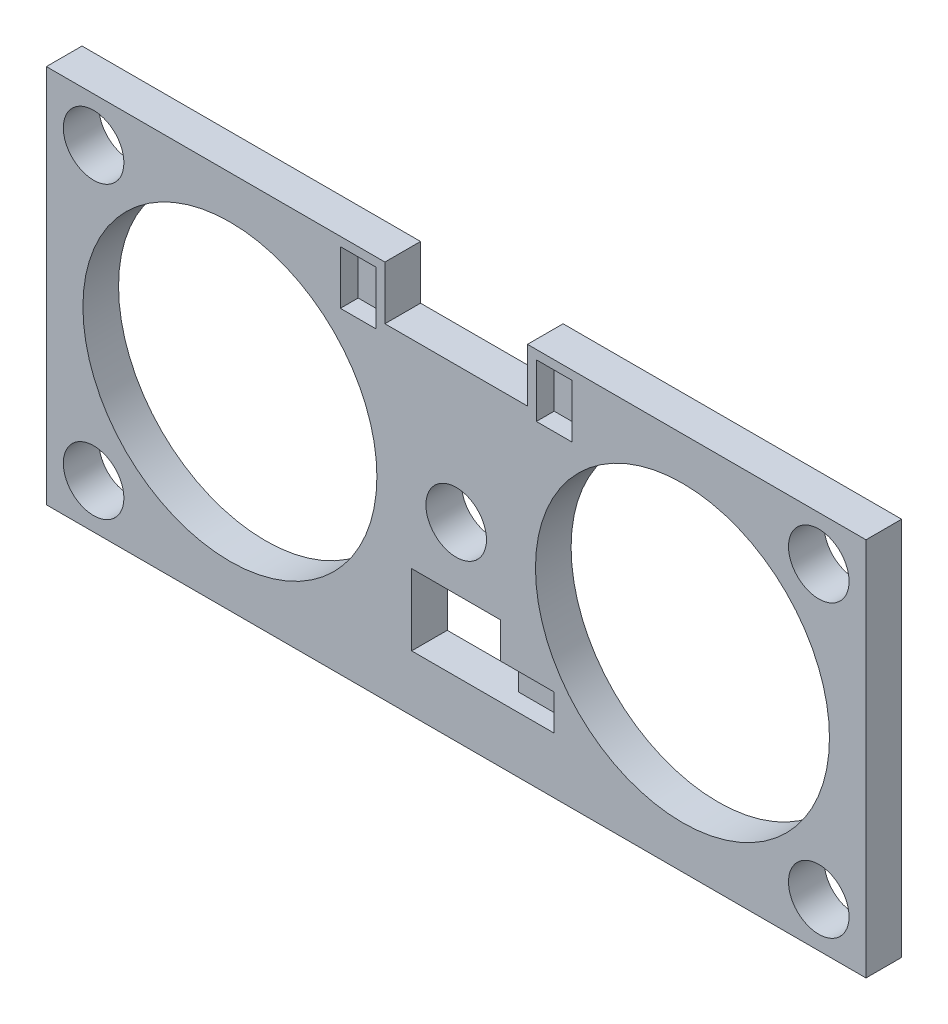
ISO-10303-21;
HEADER;
FILE_DESCRIPTION(('STEP AP214'),'2;1');
FILE_NAME('part.step','',(''),(''),'','','');
FILE_SCHEMA(('AUTOMOTIVE_DESIGN { 1 0 10303 214 1 1 1 1 }'));
ENDSEC;
DATA;
#1=APPLICATION_CONTEXT('core data for automotive mechanical design processes');
#2=APPLICATION_PROTOCOL_DEFINITION('international standard','automotive_design',2000,#1);
#3=PRODUCT_CONTEXT('',#1,'mechanical');
#4=PRODUCT('Part','Part','',(#3));
#5=PRODUCT_RELATED_PRODUCT_CATEGORY('part','',(#4));
#6=PRODUCT_DEFINITION_FORMATION('','',#4);
#7=PRODUCT_DEFINITION_CONTEXT('part definition',#1,'design');
#8=PRODUCT_DEFINITION('design','',#6,#7);
#9=PRODUCT_DEFINITION_SHAPE('','',#8);
#10=(LENGTH_UNIT() NAMED_UNIT(*) SI_UNIT(.MILLI.,.METRE.));
#11=(NAMED_UNIT(*) PLANE_ANGLE_UNIT() SI_UNIT($,.RADIAN.));
#12=(NAMED_UNIT(*) SI_UNIT($,.STERADIAN.) SOLID_ANGLE_UNIT());
#13=UNCERTAINTY_MEASURE_WITH_UNIT(LENGTH_MEASURE(1.E-05),#10,'distance_accuracy_value','');
#14=(GEOMETRIC_REPRESENTATION_CONTEXT(3) GLOBAL_UNCERTAINTY_ASSIGNED_CONTEXT((#13)) GLOBAL_UNIT_ASSIGNED_CONTEXT((#10,
#11,#12)) REPRESENTATION_CONTEXT('',''));
#15=CARTESIAN_POINT('',(0.,0.,0.));
#16=DIRECTION('',(0.,0.,1.));
#17=DIRECTION('',(1.,0.,0.));
#18=AXIS2_PLACEMENT_3D('',#15,#16,#17);
#19=CARTESIAN_POINT('',(0.,0.,2.));
#20=DIRECTION('',(0.,0.,-1.));
#21=DIRECTION('',(-1.,0.,0.));
#22=AXIS2_PLACEMENT_3D('',#19,#20,#21);
#23=PLANE('',#22);
#24=CARTESIAN_POINT('',(0.,0.,2.));
#25=DIRECTION('',(0.,0.,1.));
#26=DIRECTION('',(1.,0.,0.));
#27=AXIS2_PLACEMENT_3D('',#24,#25,#26);
#28=CIRCLE('',#27,1.7);
#29=CARTESIAN_POINT('',(1.7,0.,2.));
#30=VERTEX_POINT('',#29);
#31=EDGE_CURVE('E741',#30,#30,#28,.T.);
#32=ORIENTED_EDGE('',*,*,#31,.F.);
#33=EDGE_LOOP('',(#32));
#34=FACE_BOUND('',#33,.T.);
#35=CARTESIAN_POINT('',(-20.35,-8.15,2.));
#36=DIRECTION('',(0.,0.,1.));
#37=DIRECTION('',(1.,0.,0.));
#38=AXIS2_PLACEMENT_3D('',#35,#36,#37);
#39=CIRCLE('',#38,1.7);
#40=CARTESIAN_POINT('',(-18.65,-8.15,2.));
#41=VERTEX_POINT('',#40);
#42=EDGE_CURVE('E751',#41,#41,#39,.T.);
#43=ORIENTED_EDGE('',*,*,#42,.F.);
#44=EDGE_LOOP('',(#43));
#45=FACE_BOUND('',#44,.T.);
#46=CARTESIAN_POINT('',(-20.35,8.15,2.));
#47=DIRECTION('',(0.,0.,1.));
#48=DIRECTION('',(1.,0.,0.));
#49=AXIS2_PLACEMENT_3D('',#46,#47,#48);
#50=CIRCLE('',#49,1.7);
#51=CARTESIAN_POINT('',(-18.65,8.15,2.));
#52=VERTEX_POINT('',#51);
#53=EDGE_CURVE('E757',#52,#52,#50,.T.);
#54=ORIENTED_EDGE('',*,*,#53,.F.);
#55=EDGE_LOOP('',(#54));
#56=FACE_BOUND('',#55,.T.);
#57=DIRECTION('',(1.,0.,0.));
#58=VECTOR('',#57,1.);
#59=CARTESIAN_POINT('',(-4.5,7.15,2.));
#60=LINE('',#59,#58);
#61=CARTESIAN_POINT('',(-6.5,7.15,2.));
#62=VERTEX_POINT('',#61);
#63=CARTESIAN_POINT('',(-4.5,7.15,2.));
#64=VERTEX_POINT('',#63);
#65=EDGE_CURVE('E242',#62,#64,#60,.T.);
#66=ORIENTED_EDGE('',*,*,#65,.F.);
#67=DIRECTION('',(0.,-1.,0.));
#68=VECTOR('',#67,1.);
#69=CARTESIAN_POINT('',(-6.5,10.15,2.));
#70=LINE('',#69,#68);
#71=CARTESIAN_POINT('',(-6.5,10.15,2.));
#72=VERTEX_POINT('',#71);
#73=EDGE_CURVE('E48',#72,#62,#70,.T.);
#74=ORIENTED_EDGE('',*,*,#73,.F.);
#75=DIRECTION('',(-1.,0.,0.));
#76=VECTOR('',#75,1.);
#77=CARTESIAN_POINT('',(-4.5,10.15,2.));
#78=LINE('',#77,#76);
#79=CARTESIAN_POINT('',(-4.5,10.15,2.));
#80=VERTEX_POINT('',#79);
#81=EDGE_CURVE('E231',#80,#72,#78,.T.);
#82=ORIENTED_EDGE('',*,*,#81,.F.);
#83=DIRECTION('',(0.,1.,0.));
#84=VECTOR('',#83,1.);
#85=CARTESIAN_POINT('',(-4.5,10.15,2.));
#86=LINE('',#85,#84);
#87=EDGE_CURVE('E246',#64,#80,#86,.T.);
#88=ORIENTED_EDGE('',*,*,#87,.F.);
#89=EDGE_LOOP('',(#66,#74,#82,#88));
#90=FACE_BOUND('',#89,.T.);
#91=DIRECTION('',(1.,0.,0.));
#92=VECTOR('',#91,1.);
#93=CARTESIAN_POINT('',(6.5,7.15,2.));
#94=LINE('',#93,#92);
#95=CARTESIAN_POINT('',(4.5,7.15,2.));
#96=VERTEX_POINT('',#95);
#97=CARTESIAN_POINT('',(6.5,7.15,2.));
#98=VERTEX_POINT('',#97);
#99=EDGE_CURVE('E272',#96,#98,#94,.T.);
#100=ORIENTED_EDGE('',*,*,#99,.F.);
#101=DIRECTION('',(0.,-1.,0.));
#102=VECTOR('',#101,1.);
#103=CARTESIAN_POINT('',(4.5,10.15,2.));
#104=LINE('',#103,#102);
#105=CARTESIAN_POINT('',(4.5,10.15,2.));
#106=VERTEX_POINT('',#105);
#107=EDGE_CURVE('E56',#106,#96,#104,.T.);
#108=ORIENTED_EDGE('',*,*,#107,.F.);
#109=DIRECTION('',(-1.,0.,0.));
#110=VECTOR('',#109,1.);
#111=CARTESIAN_POINT('',(6.5,10.15,2.));
#112=LINE('',#111,#110);
#113=CARTESIAN_POINT('',(6.5,10.15,2.));
#114=VERTEX_POINT('',#113);
#115=EDGE_CURVE('E261',#114,#106,#112,.T.);
#116=ORIENTED_EDGE('',*,*,#115,.F.);
#117=DIRECTION('',(0.,1.,0.));
#118=VECTOR('',#117,1.);
#119=CARTESIAN_POINT('',(6.5,10.15,2.));
#120=LINE('',#119,#118);
#121=EDGE_CURVE('E276',#98,#114,#120,.T.);
#122=ORIENTED_EDGE('',*,*,#121,.F.);
#123=EDGE_LOOP('',(#100,#108,#116,#122));
#124=FACE_BOUND('',#123,.T.);
#125=DIRECTION('',(0.,1.,0.));
#126=VECTOR('',#125,1.);
#127=CARTESIAN_POINT('',(2.5,-3.5,2.));
#128=LINE('',#127,#126);
#129=CARTESIAN_POINT('',(2.5,-5.5,2.));
#130=VERTEX_POINT('',#129);
#131=CARTESIAN_POINT('',(2.5,-3.5,2.));
#132=VERTEX_POINT('',#131);
#133=EDGE_CURVE('E225',#130,#132,#128,.T.);
#134=ORIENTED_EDGE('',*,*,#133,.F.);
#135=DIRECTION('',(-1.,0.,0.));
#136=VECTOR('',#135,1.);
#137=CARTESIAN_POINT('',(2.5,-5.5,2.));
#138=LINE('',#137,#136);
#139=CARTESIAN_POINT('',(5.5,-5.5,2.));
#140=VERTEX_POINT('',#139);
#141=EDGE_CURVE('E213',#140,#130,#138,.T.);
#142=ORIENTED_EDGE('',*,*,#141,.F.);
#143=DIRECTION('',(0.,1.,0.));
#144=VECTOR('',#143,1.);
#145=CARTESIAN_POINT('',(5.5,-7.5,2.));
#146=LINE('',#145,#144);
#147=CARTESIAN_POINT('',(5.5,-7.5,2.));
#148=VERTEX_POINT('',#147);
#149=EDGE_CURVE('E218',#148,#140,#146,.T.);
#150=ORIENTED_EDGE('',*,*,#149,.F.);
#151=DIRECTION('',(1.,0.,0.));
#152=VECTOR('',#151,1.);
#153=CARTESIAN_POINT('',(-2.5,-7.5,2.));
#154=LINE('',#153,#152);
#155=CARTESIAN_POINT('',(-2.5,-7.5,2.));
#156=VERTEX_POINT('',#155);
#157=EDGE_CURVE('E195',#156,#148,#154,.T.);
#158=ORIENTED_EDGE('',*,*,#157,.F.);
#159=DIRECTION('',(0.,-1.,0.));
#160=VECTOR('',#159,1.);
#161=CARTESIAN_POINT('',(-2.5,-3.5,2.));
#162=LINE('',#161,#160);
#163=CARTESIAN_POINT('',(-2.5,-3.5,2.));
#164=VERTEX_POINT('',#163);
#165=EDGE_CURVE('E304',#164,#156,#162,.T.);
#166=ORIENTED_EDGE('',*,*,#165,.F.);
#167=DIRECTION('',(-1.,0.,0.));
#168=VECTOR('',#167,1.);
#169=CARTESIAN_POINT('',(-2.5,-3.5,2.));
#170=LINE('',#169,#168);
#171=EDGE_CURVE('E301',#132,#164,#170,.T.);
#172=ORIENTED_EDGE('',*,*,#171,.F.);
#173=EDGE_LOOP('',(#134,#142,#150,#158,#166,#172));
#174=FACE_BOUND('',#173,.T.);
#175=CARTESIAN_POINT('',(-12.7,0.,2.));
#176=DIRECTION('',(0.,0.,1.));
#177=DIRECTION('',(1.,0.,0.));
#178=AXIS2_PLACEMENT_3D('',#175,#176,#177);
#179=CIRCLE('',#178,8.25);
#180=CARTESIAN_POINT('',(-4.45,0.,2.));
#181=VERTEX_POINT('',#180);
#182=EDGE_CURVE('E347',#181,#181,#179,.T.);
#183=ORIENTED_EDGE('',*,*,#182,.F.);
#184=EDGE_LOOP('',(#183));
#185=FACE_BOUND('',#184,.T.);
#186=CARTESIAN_POINT('',(12.7,0.,2.));
#187=DIRECTION('',(0.,0.,1.));
#188=DIRECTION('',(1.,0.,0.));
#189=AXIS2_PLACEMENT_3D('',#186,#187,#188);
#190=CIRCLE('',#189,8.25);
#191=CARTESIAN_POINT('',(20.95,0.,2.));
#192=VERTEX_POINT('',#191);
#193=EDGE_CURVE('E336',#192,#192,#190,.T.);
#194=ORIENTED_EDGE('',*,*,#193,.F.);
#195=EDGE_LOOP('',(#194));
#196=FACE_BOUND('',#195,.T.);
#197=DIRECTION('',(-1.,0.,0.));
#198=VECTOR('',#197,1.);
#199=CARTESIAN_POINT('',(-23.,10.65,2.));
#200=LINE('',#199,#198);
#201=CARTESIAN_POINT('',(23.,10.65,2.));
#202=VERTEX_POINT('',#201);
#203=CARTESIAN_POINT('',(4.,10.65,2.));
#204=VERTEX_POINT('',#203);
#205=EDGE_CURVE('E360',#202,#204,#200,.T.);
#206=ORIENTED_EDGE('',*,*,#205,.T.);
#207=DIRECTION('',(0.,1.,0.));
#208=VECTOR('',#207,1.);
#209=CARTESIAN_POINT('',(4.,7.65,2.));
#210=LINE('',#209,#208);
#211=CARTESIAN_POINT('',(4.,7.65,2.));
#212=VERTEX_POINT('',#211);
#213=EDGE_CURVE('E310',#212,#204,#210,.T.);
#214=ORIENTED_EDGE('',*,*,#213,.F.);
#215=DIRECTION('',(1.,0.,0.));
#216=VECTOR('',#215,1.);
#217=CARTESIAN_POINT('',(-4.,7.65,2.));
#218=LINE('',#217,#216);
#219=CARTESIAN_POINT('',(-4.,7.65,2.));
#220=VERTEX_POINT('',#219);
#221=EDGE_CURVE('E321',#220,#212,#218,.T.);
#222=ORIENTED_EDGE('',*,*,#221,.F.);
#223=DIRECTION('',(0.,-1.,0.));
#224=VECTOR('',#223,1.);
#225=CARTESIAN_POINT('',(-4.,7.65,2.));
#226=LINE('',#225,#224);
#227=CARTESIAN_POINT('',(-4.,10.65,2.));
#228=VERTEX_POINT('',#227);
#229=EDGE_CURVE('E329',#228,#220,#226,.T.);
#230=ORIENTED_EDGE('',*,*,#229,.F.);
#231=CARTESIAN_POINT('',(-23.,10.65,2.));
#232=VERTEX_POINT('',#231);
#233=EDGE_CURVE('E358',#228,#232,#200,.T.);
#234=ORIENTED_EDGE('',*,*,#233,.T.);
#235=DIRECTION('',(0.,-1.,0.));
#236=VECTOR('',#235,1.);
#237=CARTESIAN_POINT('',(-23.,-10.65,2.));
#238=LINE('',#237,#236);
#239=CARTESIAN_POINT('',(-23.,-10.65,2.));
#240=VERTEX_POINT('',#239);
#241=EDGE_CURVE('E363',#232,#240,#238,.T.);
#242=ORIENTED_EDGE('',*,*,#241,.T.);
#243=DIRECTION('',(1.,0.,0.));
#244=VECTOR('',#243,1.);
#245=CARTESIAN_POINT('',(-23.,-10.65,2.));
#246=LINE('',#245,#244);
#247=CARTESIAN_POINT('',(23.,-10.65,2.));
#248=VERTEX_POINT('',#247);
#249=EDGE_CURVE('E365',#240,#248,#246,.T.);
#250=ORIENTED_EDGE('',*,*,#249,.T.);
#251=DIRECTION('',(0.,1.,0.));
#252=VECTOR('',#251,1.);
#253=CARTESIAN_POINT('',(23.,-10.65,2.));
#254=LINE('',#253,#252);
#255=EDGE_CURVE('E355',#248,#202,#254,.T.);
#256=ORIENTED_EDGE('',*,*,#255,.T.);
#257=EDGE_LOOP('',(#206,#214,#222,#230,#234,#242,#250,#256));
#258=FACE_BOUND('',#257,.T.);
#259=CARTESIAN_POINT('',(20.35,-8.15,2.));
#260=DIRECTION('',(0.,0.,1.));
#261=DIRECTION('',(1.,0.,0.));
#262=AXIS2_PLACEMENT_3D('',#259,#260,#261);
#263=CIRCLE('',#262,1.7);
#264=CARTESIAN_POINT('',(22.05,-8.15,2.));
#265=VERTEX_POINT('',#264);
#266=EDGE_CURVE('E763',#265,#265,#263,.T.);
#267=ORIENTED_EDGE('',*,*,#266,.F.);
#268=EDGE_LOOP('',(#267));
#269=FACE_BOUND('',#268,.T.);
#270=CARTESIAN_POINT('',(20.35,8.15,2.));
#271=DIRECTION('',(0.,0.,1.));
#272=DIRECTION('',(1.,0.,0.));
#273=AXIS2_PLACEMENT_3D('',#270,#271,#272);
#274=CIRCLE('',#273,1.7);
#275=CARTESIAN_POINT('',(22.05,8.15,2.));
#276=VERTEX_POINT('',#275);
#277=EDGE_CURVE('E743',#276,#276,#274,.T.);
#278=ORIENTED_EDGE('',*,*,#277,.F.);
#279=EDGE_LOOP('',(#278));
#280=FACE_BOUND('',#279,.T.);
#281=ADVANCED_FACE('F33',(#34,#45,#56,#90,#124,#174,#185,#196,#258,#269,#280),#23,.F.);
#282=CARTESIAN_POINT('',(0.,0.,0.));
#283=DIRECTION('',(0.,0.,-1.));
#284=DIRECTION('',(-1.,0.,0.));
#285=AXIS2_PLACEMENT_3D('',#282,#283,#284);
#286=PLANE('',#285);
#287=CARTESIAN_POINT('',(0.,0.,0.));
#288=DIRECTION('',(0.,0.,1.));
#289=DIRECTION('',(1.,0.,0.));
#290=AXIS2_PLACEMENT_3D('',#287,#288,#289);
#291=CIRCLE('',#290,1.7);
#292=CARTESIAN_POINT('',(1.7,0.,0.));
#293=VERTEX_POINT('',#292);
#294=EDGE_CURVE('E739',#293,#293,#291,.T.);
#295=ORIENTED_EDGE('',*,*,#294,.T.);
#296=EDGE_LOOP('',(#295));
#297=FACE_BOUND('',#296,.T.);
#298=CARTESIAN_POINT('',(20.35,8.15,0.));
#299=DIRECTION('',(0.,0.,1.));
#300=DIRECTION('',(1.,0.,0.));
#301=AXIS2_PLACEMENT_3D('',#298,#299,#300);
#302=CIRCLE('',#301,1.7);
#303=CARTESIAN_POINT('',(22.05,8.15,0.));
#304=VERTEX_POINT('',#303);
#305=EDGE_CURVE('E748',#304,#304,#302,.T.);
#306=ORIENTED_EDGE('',*,*,#305,.T.);
#307=EDGE_LOOP('',(#306));
#308=FACE_BOUND('',#307,.T.);
#309=CARTESIAN_POINT('',(-20.35,-8.15,0.));
#310=DIRECTION('',(0.,0.,1.));
#311=DIRECTION('',(1.,0.,0.));
#312=AXIS2_PLACEMENT_3D('',#309,#310,#311);
#313=CIRCLE('',#312,1.7);
#314=CARTESIAN_POINT('',(-18.65,-8.15,0.));
#315=VERTEX_POINT('',#314);
#316=EDGE_CURVE('E754',#315,#315,#313,.T.);
#317=ORIENTED_EDGE('',*,*,#316,.T.);
#318=EDGE_LOOP('',(#317));
#319=FACE_BOUND('',#318,.T.);
#320=CARTESIAN_POINT('',(-20.35,8.15,0.));
#321=DIRECTION('',(0.,0.,1.));
#322=DIRECTION('',(1.,0.,0.));
#323=AXIS2_PLACEMENT_3D('',#320,#321,#322);
#324=CIRCLE('',#323,1.7);
#325=CARTESIAN_POINT('',(-18.65,8.15,0.));
#326=VERTEX_POINT('',#325);
#327=EDGE_CURVE('E760',#326,#326,#324,.T.);
#328=ORIENTED_EDGE('',*,*,#327,.T.);
#329=EDGE_LOOP('',(#328));
#330=FACE_BOUND('',#329,.T.);
#331=CARTESIAN_POINT('',(12.7,0.,0.));
#332=DIRECTION('',(0.,0.,1.));
#333=DIRECTION('',(1.,0.,0.));
#334=AXIS2_PLACEMENT_3D('',#331,#332,#333);
#335=CIRCLE('',#334,8.25);
#336=CARTESIAN_POINT('',(20.95,0.,0.));
#337=VERTEX_POINT('',#336);
#338=EDGE_CURVE('E350',#337,#337,#335,.T.);
#339=ORIENTED_EDGE('',*,*,#338,.T.);
#340=EDGE_LOOP('',(#339));
#341=FACE_BOUND('',#340,.T.);
#342=CARTESIAN_POINT('',(-12.7,0.,0.));
#343=DIRECTION('',(0.,0.,1.));
#344=DIRECTION('',(1.,0.,0.));
#345=AXIS2_PLACEMENT_3D('',#342,#343,#344);
#346=CIRCLE('',#345,8.25);
#347=CARTESIAN_POINT('',(-4.45,0.,0.));
#348=VERTEX_POINT('',#347);
#349=EDGE_CURVE('E343',#348,#348,#346,.T.);
#350=ORIENTED_EDGE('',*,*,#349,.T.);
#351=EDGE_LOOP('',(#350));
#352=FACE_BOUND('',#351,.T.);
#353=DIRECTION('',(0.,1.,0.));
#354=VECTOR('',#353,1.);
#355=CARTESIAN_POINT('',(4.,7.65,0.));
#356=LINE('',#355,#354);
#357=CARTESIAN_POINT('',(4.,7.65,0.));
#358=VERTEX_POINT('',#357);
#359=CARTESIAN_POINT('',(4.,10.65,0.));
#360=VERTEX_POINT('',#359);
#361=EDGE_CURVE('E317',#358,#360,#356,.T.);
#362=ORIENTED_EDGE('',*,*,#361,.T.);
#363=DIRECTION('',(-1.,0.,0.));
#364=VECTOR('',#363,1.);
#365=CARTESIAN_POINT('',(-23.,10.65,0.));
#366=LINE('',#365,#364);
#367=CARTESIAN_POINT('',(23.,10.65,0.));
#368=VERTEX_POINT('',#367);
#369=EDGE_CURVE('E371',#368,#360,#366,.T.);
#370=ORIENTED_EDGE('',*,*,#369,.F.);
#371=DIRECTION('',(0.,1.,0.));
#372=VECTOR('',#371,1.);
#373=CARTESIAN_POINT('',(23.,-10.65,0.));
#374=LINE('',#373,#372);
#375=CARTESIAN_POINT('',(23.,-10.65,0.));
#376=VERTEX_POINT('',#375);
#377=EDGE_CURVE('E346',#376,#368,#374,.T.);
#378=ORIENTED_EDGE('',*,*,#377,.F.);
#379=DIRECTION('',(1.,0.,0.));
#380=VECTOR('',#379,1.);
#381=CARTESIAN_POINT('',(-23.,-10.65,0.));
#382=LINE('',#381,#380);
#383=CARTESIAN_POINT('',(-23.,-10.65,0.));
#384=VERTEX_POINT('',#383);
#385=EDGE_CURVE('E359',#384,#376,#382,.T.);
#386=ORIENTED_EDGE('',*,*,#385,.F.);
#387=DIRECTION('',(0.,-1.,0.));
#388=VECTOR('',#387,1.);
#389=CARTESIAN_POINT('',(-23.,-10.65,0.));
#390=LINE('',#389,#388);
#391=CARTESIAN_POINT('',(-23.,10.65,0.));
#392=VERTEX_POINT('',#391);
#393=EDGE_CURVE('E374',#392,#384,#390,.T.);
#394=ORIENTED_EDGE('',*,*,#393,.F.);
#395=CARTESIAN_POINT('',(-4.,10.65,0.));
#396=VERTEX_POINT('',#395);
#397=EDGE_CURVE('E370',#396,#392,#366,.T.);
#398=ORIENTED_EDGE('',*,*,#397,.F.);
#399=DIRECTION('',(0.,-1.,0.));
#400=VECTOR('',#399,1.);
#401=CARTESIAN_POINT('',(-4.,7.65,0.));
#402=LINE('',#401,#400);
#403=CARTESIAN_POINT('',(-4.,7.65,0.));
#404=VERTEX_POINT('',#403);
#405=EDGE_CURVE('E320',#396,#404,#402,.T.);
#406=ORIENTED_EDGE('',*,*,#405,.T.);
#407=DIRECTION('',(1.,0.,0.));
#408=VECTOR('',#407,1.);
#409=CARTESIAN_POINT('',(-4.,7.65,0.));
#410=LINE('',#409,#408);
#411=EDGE_CURVE('E324',#404,#358,#410,.T.);
#412=ORIENTED_EDGE('',*,*,#411,.T.);
#413=EDGE_LOOP('',(#362,#370,#378,#386,#394,#398,#406,#412));
#414=FACE_BOUND('',#413,.T.);
#415=DIRECTION('',(0.,1.,0.));
#416=VECTOR('',#415,1.);
#417=CARTESIAN_POINT('',(2.5,-3.5,0.));
#418=LINE('',#417,#416);
#419=CARTESIAN_POINT('',(2.5,-7.5,0.));
#420=VERTEX_POINT('',#419);
#421=CARTESIAN_POINT('',(2.5,-3.5,0.));
#422=VERTEX_POINT('',#421);
#423=EDGE_CURVE('E287',#420,#422,#418,.T.);
#424=ORIENTED_EDGE('',*,*,#423,.T.);
#425=DIRECTION('',(-1.,0.,0.));
#426=VECTOR('',#425,1.);
#427=CARTESIAN_POINT('',(-2.5,-3.5,0.));
#428=LINE('',#427,#426);
#429=CARTESIAN_POINT('',(-2.5,-3.5,0.));
#430=VERTEX_POINT('',#429);
#431=EDGE_CURVE('E290',#422,#430,#428,.T.);
#432=ORIENTED_EDGE('',*,*,#431,.T.);
#433=DIRECTION('',(0.,-1.,0.));
#434=VECTOR('',#433,1.);
#435=CARTESIAN_POINT('',(-2.5,-3.5,0.));
#436=LINE('',#435,#434);
#437=CARTESIAN_POINT('',(-2.5,-7.5,0.));
#438=VERTEX_POINT('',#437);
#439=EDGE_CURVE('E293',#430,#438,#436,.T.);
#440=ORIENTED_EDGE('',*,*,#439,.T.);
#441=DIRECTION('',(1.,0.,0.));
#442=VECTOR('',#441,1.);
#443=CARTESIAN_POINT('',(-2.5,-7.5,0.));
#444=LINE('',#443,#442);
#445=EDGE_CURVE('E296',#438,#420,#444,.T.);
#446=ORIENTED_EDGE('',*,*,#445,.T.);
#447=EDGE_LOOP('',(#424,#432,#440,#446));
#448=FACE_BOUND('',#447,.T.);
#449=CARTESIAN_POINT('',(20.35,-8.15,0.));
#450=DIRECTION('',(0.,0.,1.));
#451=DIRECTION('',(1.,0.,0.));
#452=AXIS2_PLACEMENT_3D('',#449,#450,#451);
#453=CIRCLE('',#452,1.7);
#454=CARTESIAN_POINT('',(22.05,-8.15,0.));
#455=VERTEX_POINT('',#454);
#456=EDGE_CURVE('E273',#455,#455,#453,.T.);
#457=ORIENTED_EDGE('',*,*,#456,.T.);
#458=EDGE_LOOP('',(#457));
#459=FACE_BOUND('',#458,.T.);
#460=ADVANCED_FACE('F393',(#297,#308,#319,#330,#341,#352,#414,#448,#459),#286,.T.);
#461=CARTESIAN_POINT('',(-23.,10.65,2.));
#462=DIRECTION('',(0.,-1.,0.));
#463=DIRECTION('',(0.,0.,-1.));
#464=AXIS2_PLACEMENT_3D('',#461,#462,#463);
#465=PLANE('',#464);
#466=ORIENTED_EDGE('',*,*,#369,.T.);
#467=DIRECTION('',(0.,0.,1.));
#468=VECTOR('',#467,1.);
#469=CARTESIAN_POINT('',(4.,10.65,0.));
#470=LINE('',#469,#468);
#471=EDGE_CURVE('E327',#360,#204,#470,.T.);
#472=ORIENTED_EDGE('',*,*,#471,.T.);
#473=ORIENTED_EDGE('',*,*,#205,.F.);
#474=DIRECTION('',(0.,0.,-1.));
#475=VECTOR('',#474,1.);
#476=CARTESIAN_POINT('',(23.,10.65,2.));
#477=LINE('',#476,#475);
#478=EDGE_CURVE('E11',#202,#368,#477,.T.);
#479=ORIENTED_EDGE('',*,*,#478,.T.);
#480=EDGE_LOOP('',(#466,#472,#473,#479));
#481=FACE_BOUND('',#480,.T.);
#482=ADVANCED_FACE('F419',(#481),#465,.F.);
#483=CARTESIAN_POINT('',(23.,-10.65,2.));
#484=DIRECTION('',(-1.,0.,0.));
#485=DIRECTION('',(0.,0.,1.));
#486=AXIS2_PLACEMENT_3D('',#483,#484,#485);
#487=PLANE('',#486);
#488=ORIENTED_EDGE('',*,*,#377,.T.);
#489=ORIENTED_EDGE('',*,*,#478,.F.);
#490=ORIENTED_EDGE('',*,*,#255,.F.);
#491=DIRECTION('',(0.,0.,-1.));
#492=VECTOR('',#491,1.);
#493=CARTESIAN_POINT('',(23.,-10.65,2.));
#494=LINE('',#493,#492);
#495=EDGE_CURVE('E367',#248,#376,#494,.T.);
#496=ORIENTED_EDGE('',*,*,#495,.T.);
#497=EDGE_LOOP('',(#488,#489,#490,#496));
#498=FACE_BOUND('',#497,.T.);
#499=ADVANCED_FACE('F35',(#498),#487,.F.);
#500=ORIENTED_EDGE('',*,*,#233,.F.);
#501=DIRECTION('',(0.,0.,1.));
#502=VECTOR('',#501,1.);
#503=CARTESIAN_POINT('',(-4.,10.65,0.));
#504=LINE('',#503,#502);
#505=EDGE_CURVE('E339',#396,#228,#504,.T.);
#506=ORIENTED_EDGE('',*,*,#505,.F.);
#507=ORIENTED_EDGE('',*,*,#397,.T.);
#508=DIRECTION('',(0.,0.,-1.));
#509=VECTOR('',#508,1.);
#510=CARTESIAN_POINT('',(-23.,10.65,2.));
#511=LINE('',#510,#509);
#512=EDGE_CURVE('E41',#232,#392,#511,.T.);
#513=ORIENTED_EDGE('',*,*,#512,.F.);
#514=EDGE_LOOP('',(#500,#506,#507,#513));
#515=FACE_BOUND('',#514,.T.);
#516=ADVANCED_FACE('F409',(#515),#465,.F.);
#517=CARTESIAN_POINT('',(-23.,-10.65,2.));
#518=DIRECTION('',(1.,0.,0.));
#519=DIRECTION('',(0.,0.,-1.));
#520=AXIS2_PLACEMENT_3D('',#517,#518,#519);
#521=PLANE('',#520);
#522=ORIENTED_EDGE('',*,*,#393,.T.);
#523=DIRECTION('',(0.,0.,-1.));
#524=VECTOR('',#523,1.);
#525=CARTESIAN_POINT('',(-23.,-10.65,2.));
#526=LINE('',#525,#524);
#527=EDGE_CURVE('E379',#240,#384,#526,.T.);
#528=ORIENTED_EDGE('',*,*,#527,.F.);
#529=ORIENTED_EDGE('',*,*,#241,.F.);
#530=ORIENTED_EDGE('',*,*,#512,.T.);
#531=EDGE_LOOP('',(#522,#528,#529,#530));
#532=FACE_BOUND('',#531,.T.);
#533=ADVANCED_FACE('F386',(#532),#521,.F.);
#534=CARTESIAN_POINT('',(-23.,-10.65,2.));
#535=DIRECTION('',(0.,1.,0.));
#536=DIRECTION('',(0.,0.,1.));
#537=AXIS2_PLACEMENT_3D('',#534,#535,#536);
#538=PLANE('',#537);
#539=ORIENTED_EDGE('',*,*,#385,.T.);
#540=ORIENTED_EDGE('',*,*,#495,.F.);
#541=ORIENTED_EDGE('',*,*,#249,.F.);
#542=ORIENTED_EDGE('',*,*,#527,.T.);
#543=EDGE_LOOP('',(#539,#540,#541,#542));
#544=FACE_BOUND('',#543,.T.);
#545=ADVANCED_FACE('F398',(#544),#538,.F.);
#546=CARTESIAN_POINT('',(12.7,0.,0.));
#547=DIRECTION('',(0.,0.,1.));
#548=DIRECTION('',(1.,0.,0.));
#549=AXIS2_PLACEMENT_3D('',#546,#547,#548);
#550=CYLINDRICAL_SURFACE('',#549,8.25);
#551=ORIENTED_EDGE('',*,*,#338,.F.);
#552=EDGE_LOOP('',(#551));
#553=FACE_BOUND('',#552,.T.);
#554=ORIENTED_EDGE('',*,*,#193,.T.);
#555=EDGE_LOOP('',(#554));
#556=FACE_BOUND('',#555,.T.);
#557=ADVANCED_FACE('F437',(#553,#556),#550,.F.);
#558=CARTESIAN_POINT('',(-12.7,0.,0.));
#559=DIRECTION('',(0.,0.,1.));
#560=DIRECTION('',(1.,0.,0.));
#561=AXIS2_PLACEMENT_3D('',#558,#559,#560);
#562=CYLINDRICAL_SURFACE('',#561,8.25);
#563=ORIENTED_EDGE('',*,*,#349,.F.);
#564=EDGE_LOOP('',(#563));
#565=FACE_BOUND('',#564,.T.);
#566=ORIENTED_EDGE('',*,*,#182,.T.);
#567=EDGE_LOOP('',(#566));
#568=FACE_BOUND('',#567,.T.);
#569=ADVANCED_FACE('F457',(#565,#568),#562,.F.);
#570=CARTESIAN_POINT('',(4.,7.65,0.));
#571=DIRECTION('',(1.,0.,0.));
#572=DIRECTION('',(0.,0.,-1.));
#573=AXIS2_PLACEMENT_3D('',#570,#571,#572);
#574=PLANE('',#573);
#575=ORIENTED_EDGE('',*,*,#213,.T.);
#576=ORIENTED_EDGE('',*,*,#471,.F.);
#577=ORIENTED_EDGE('',*,*,#361,.F.);
#578=DIRECTION('',(0.,0.,1.));
#579=VECTOR('',#578,1.);
#580=CARTESIAN_POINT('',(4.,7.65,0.));
#581=LINE('',#580,#579);
#582=EDGE_CURVE('E334',#358,#212,#581,.T.);
#583=ORIENTED_EDGE('',*,*,#582,.T.);
#584=EDGE_LOOP('',(#575,#576,#577,#583));
#585=FACE_BOUND('',#584,.T.);
#586=ADVANCED_FACE('F417',(#585),#574,.F.);
#587=CARTESIAN_POINT('',(-4.,7.65,0.));
#588=DIRECTION('',(0.,-1.,0.));
#589=DIRECTION('',(0.,0.,-1.));
#590=AXIS2_PLACEMENT_3D('',#587,#588,#589);
#591=PLANE('',#590);
#592=ORIENTED_EDGE('',*,*,#221,.T.);
#593=ORIENTED_EDGE('',*,*,#582,.F.);
#594=ORIENTED_EDGE('',*,*,#411,.F.);
#595=DIRECTION('',(0.,0.,1.));
#596=VECTOR('',#595,1.);
#597=CARTESIAN_POINT('',(-4.,7.65,0.));
#598=LINE('',#597,#596);
#599=EDGE_CURVE('E337',#404,#220,#598,.T.);
#600=ORIENTED_EDGE('',*,*,#599,.T.);
#601=EDGE_LOOP('',(#592,#593,#594,#600));
#602=FACE_BOUND('',#601,.T.);
#603=ADVANCED_FACE('F415',(#602),#591,.F.);
#604=CARTESIAN_POINT('',(-4.,7.65,0.));
#605=DIRECTION('',(-1.,0.,0.));
#606=DIRECTION('',(0.,0.,1.));
#607=AXIS2_PLACEMENT_3D('',#604,#605,#606);
#608=PLANE('',#607);
#609=ORIENTED_EDGE('',*,*,#229,.T.);
#610=ORIENTED_EDGE('',*,*,#599,.F.);
#611=ORIENTED_EDGE('',*,*,#405,.F.);
#612=ORIENTED_EDGE('',*,*,#505,.T.);
#613=EDGE_LOOP('',(#609,#610,#611,#612));
#614=FACE_BOUND('',#613,.T.);
#615=ADVANCED_FACE('F411',(#614),#608,.F.);
#616=CARTESIAN_POINT('',(2.5,-3.5,0.));
#617=DIRECTION('',(1.,0.,0.));
#618=DIRECTION('',(0.,1.,0.));
#619=AXIS2_PLACEMENT_3D('',#616,#617,#618);
#620=PLANE('',#619);
#621=DIRECTION('',(0.,-1.,0.));
#622=VECTOR('',#621,1.);
#623=CARTESIAN_POINT('',(2.5,-7.5,1.));
#624=LINE('',#623,#622);
#625=CARTESIAN_POINT('',(2.5,-5.5,1.));
#626=VERTEX_POINT('',#625);
#627=CARTESIAN_POINT('',(2.5,-7.5,1.));
#628=VERTEX_POINT('',#627);
#629=EDGE_CURVE('E211',#626,#628,#624,.T.);
#630=ORIENTED_EDGE('',*,*,#629,.F.);
#631=DIRECTION('',(0.,0.,1.));
#632=VECTOR('',#631,1.);
#633=CARTESIAN_POINT('',(2.5,-5.5,1.));
#634=LINE('',#633,#632);
#635=EDGE_CURVE('E222',#626,#130,#634,.T.);
#636=ORIENTED_EDGE('',*,*,#635,.T.);
#637=ORIENTED_EDGE('',*,*,#133,.T.);
#638=DIRECTION('',(0.,0.,1.));
#639=VECTOR('',#638,1.);
#640=CARTESIAN_POINT('',(2.5,-3.5,0.));
#641=LINE('',#640,#639);
#642=EDGE_CURVE('E299',#422,#132,#641,.T.);
#643=ORIENTED_EDGE('',*,*,#642,.F.);
#644=ORIENTED_EDGE('',*,*,#423,.F.);
#645=DIRECTION('',(0.,0.,1.));
#646=VECTOR('',#645,1.);
#647=CARTESIAN_POINT('',(2.5,-7.5,0.));
#648=LINE('',#647,#646);
#649=EDGE_CURVE('E308',#420,#628,#648,.T.);
#650=ORIENTED_EDGE('',*,*,#649,.T.);
#651=EDGE_LOOP('',(#630,#636,#637,#643,#644,#650));
#652=FACE_BOUND('',#651,.T.);
#653=ADVANCED_FACE('F482',(#652),#620,.F.);
#654=CARTESIAN_POINT('',(-2.5,-7.5,0.));
#655=DIRECTION('',(0.,-1.,0.));
#656=DIRECTION('',(0.,0.,-1.));
#657=AXIS2_PLACEMENT_3D('',#654,#655,#656);
#658=PLANE('',#657);
#659=ORIENTED_EDGE('',*,*,#157,.T.);
#660=DIRECTION('',(0.,0.,1.));
#661=VECTOR('',#660,1.);
#662=CARTESIAN_POINT('',(5.5,-7.5,1.));
#663=LINE('',#662,#661);
#664=CARTESIAN_POINT('',(5.5,-7.5,1.));
#665=VERTEX_POINT('',#664);
#666=EDGE_CURVE('E188',#665,#148,#663,.T.);
#667=ORIENTED_EDGE('',*,*,#666,.F.);
#668=DIRECTION('',(1.,0.,0.));
#669=VECTOR('',#668,1.);
#670=CARTESIAN_POINT('',(2.5,-7.5,1.));
#671=LINE('',#670,#669);
#672=EDGE_CURVE('E192',#628,#665,#671,.T.);
#673=ORIENTED_EDGE('',*,*,#672,.F.);
#674=ORIENTED_EDGE('',*,*,#649,.F.);
#675=ORIENTED_EDGE('',*,*,#445,.F.);
#676=DIRECTION('',(0.,0.,1.));
#677=VECTOR('',#676,1.);
#678=CARTESIAN_POINT('',(-2.5,-7.5,0.));
#679=LINE('',#678,#677);
#680=EDGE_CURVE('E311',#438,#156,#679,.T.);
#681=ORIENTED_EDGE('',*,*,#680,.T.);
#682=EDGE_LOOP('',(#659,#667,#673,#674,#675,#681));
#683=FACE_BOUND('',#682,.T.);
#684=ADVANCED_FACE('F190',(#683),#658,.F.);
#685=CARTESIAN_POINT('',(-2.5,-3.5,0.));
#686=DIRECTION('',(-1.,0.,0.));
#687=DIRECTION('',(0.,-1.,0.));
#688=AXIS2_PLACEMENT_3D('',#685,#686,#687);
#689=PLANE('',#688);
#690=ORIENTED_EDGE('',*,*,#165,.T.);
#691=ORIENTED_EDGE('',*,*,#680,.F.);
#692=ORIENTED_EDGE('',*,*,#439,.F.);
#693=DIRECTION('',(0.,0.,1.));
#694=VECTOR('',#693,1.);
#695=CARTESIAN_POINT('',(-2.5,-3.5,0.));
#696=LINE('',#695,#694);
#697=EDGE_CURVE('E313',#430,#164,#696,.T.);
#698=ORIENTED_EDGE('',*,*,#697,.T.);
#699=EDGE_LOOP('',(#690,#691,#692,#698));
#700=FACE_BOUND('',#699,.T.);
#701=ADVANCED_FACE('F498',(#700),#689,.F.);
#702=CARTESIAN_POINT('',(-2.5,-3.5,0.));
#703=DIRECTION('',(0.,1.,0.));
#704=DIRECTION('',(0.,0.,1.));
#705=AXIS2_PLACEMENT_3D('',#702,#703,#704);
#706=PLANE('',#705);
#707=ORIENTED_EDGE('',*,*,#171,.T.);
#708=ORIENTED_EDGE('',*,*,#697,.F.);
#709=ORIENTED_EDGE('',*,*,#431,.F.);
#710=ORIENTED_EDGE('',*,*,#642,.T.);
#711=EDGE_LOOP('',(#707,#708,#709,#710));
#712=FACE_BOUND('',#711,.T.);
#713=ADVANCED_FACE('F505',(#712),#706,.F.);
#714=CARTESIAN_POINT('',(2.5,-5.5,1.));
#715=DIRECTION('',(0.,1.,0.));
#716=DIRECTION('',(0.,0.,1.));
#717=AXIS2_PLACEMENT_3D('',#714,#715,#716);
#718=PLANE('',#717);
#719=ORIENTED_EDGE('',*,*,#141,.T.);
#720=ORIENTED_EDGE('',*,*,#635,.F.);
#721=DIRECTION('',(-1.,0.,0.));
#722=VECTOR('',#721,1.);
#723=CARTESIAN_POINT('',(2.5,-5.5,1.));
#724=LINE('',#723,#722);
#725=CARTESIAN_POINT('',(5.5,-5.5,1.));
#726=VERTEX_POINT('',#725);
#727=EDGE_CURVE('E200',#726,#626,#724,.T.);
#728=ORIENTED_EDGE('',*,*,#727,.F.);
#729=DIRECTION('',(0.,0.,1.));
#730=VECTOR('',#729,1.);
#731=CARTESIAN_POINT('',(5.5,-5.5,1.));
#732=LINE('',#731,#730);
#733=EDGE_CURVE('E199',#726,#140,#732,.T.);
#734=ORIENTED_EDGE('',*,*,#733,.T.);
#735=EDGE_LOOP('',(#719,#720,#728,#734));
#736=FACE_BOUND('',#735,.T.);
#737=ADVANCED_FACE('F512',(#736),#718,.F.);
#738=CARTESIAN_POINT('',(5.5,-7.5,1.));
#739=DIRECTION('',(1.,0.,0.));
#740=DIRECTION('',(0.,0.,-1.));
#741=AXIS2_PLACEMENT_3D('',#738,#739,#740);
#742=PLANE('',#741);
#743=ORIENTED_EDGE('',*,*,#149,.T.);
#744=ORIENTED_EDGE('',*,*,#733,.F.);
#745=DIRECTION('',(0.,1.,0.));
#746=VECTOR('',#745,1.);
#747=CARTESIAN_POINT('',(5.5,-7.5,1.));
#748=LINE('',#747,#746);
#749=EDGE_CURVE('E203',#665,#726,#748,.T.);
#750=ORIENTED_EDGE('',*,*,#749,.F.);
#751=ORIENTED_EDGE('',*,*,#666,.T.);
#752=EDGE_LOOP('',(#743,#744,#750,#751));
#753=FACE_BOUND('',#752,.T.);
#754=ADVANCED_FACE('F204',(#753),#742,.F.);
#755=CARTESIAN_POINT('',(0.,0.,1.));
#756=DIRECTION('',(0.,0.,-1.));
#757=DIRECTION('',(-1.,0.,0.));
#758=AXIS2_PLACEMENT_3D('',#755,#756,#757);
#759=PLANE('',#758);
#760=ORIENTED_EDGE('',*,*,#629,.T.);
#761=ORIENTED_EDGE('',*,*,#672,.T.);
#762=ORIENTED_EDGE('',*,*,#749,.T.);
#763=ORIENTED_EDGE('',*,*,#727,.T.);
#764=EDGE_LOOP('',(#760,#761,#762,#763));
#765=FACE_BOUND('',#764,.T.);
#766=ADVANCED_FACE('F209',(#765),#759,.F.);
#767=CARTESIAN_POINT('',(4.5,10.15,1.));
#768=DIRECTION('',(-1.,0.,0.));
#769=DIRECTION('',(0.,0.,1.));
#770=AXIS2_PLACEMENT_3D('',#767,#768,#769);
#771=PLANE('',#770);
#772=ORIENTED_EDGE('',*,*,#107,.T.);
#773=DIRECTION('',(0.,0.,1.));
#774=VECTOR('',#773,1.);
#775=CARTESIAN_POINT('',(4.5,7.15,1.));
#776=LINE('',#775,#774);
#777=CARTESIAN_POINT('',(4.5,7.15,1.));
#778=VERTEX_POINT('',#777);
#779=EDGE_CURVE('E270',#778,#96,#776,.T.);
#780=ORIENTED_EDGE('',*,*,#779,.F.);
#781=DIRECTION('',(0.,-1.,0.));
#782=VECTOR('',#781,1.);
#783=CARTESIAN_POINT('',(4.5,10.15,1.));
#784=LINE('',#783,#782);
#785=CARTESIAN_POINT('',(4.5,10.15,1.));
#786=VERTEX_POINT('',#785);
#787=EDGE_CURVE('E257',#786,#778,#784,.T.);
#788=ORIENTED_EDGE('',*,*,#787,.F.);
#789=DIRECTION('',(0.,0.,1.));
#790=VECTOR('',#789,1.);
#791=CARTESIAN_POINT('',(4.5,10.15,1.));
#792=LINE('',#791,#790);
#793=EDGE_CURVE('E243',#786,#106,#792,.T.);
#794=ORIENTED_EDGE('',*,*,#793,.T.);
#795=EDGE_LOOP('',(#772,#780,#788,#794));
#796=FACE_BOUND('',#795,.T.);
#797=ADVANCED_FACE('F532',(#796),#771,.F.);
#798=CARTESIAN_POINT('',(6.5,10.15,1.));
#799=DIRECTION('',(0.,1.,0.));
#800=DIRECTION('',(0.,0.,1.));
#801=AXIS2_PLACEMENT_3D('',#798,#799,#800);
#802=PLANE('',#801);
#803=ORIENTED_EDGE('',*,*,#115,.T.);
#804=ORIENTED_EDGE('',*,*,#793,.F.);
#805=DIRECTION('',(-1.,0.,0.));
#806=VECTOR('',#805,1.);
#807=CARTESIAN_POINT('',(6.5,10.15,1.));
#808=LINE('',#807,#806);
#809=CARTESIAN_POINT('',(6.5,10.15,1.));
#810=VERTEX_POINT('',#809);
#811=EDGE_CURVE('E267',#810,#786,#808,.T.);
#812=ORIENTED_EDGE('',*,*,#811,.F.);
#813=DIRECTION('',(0.,0.,1.));
#814=VECTOR('',#813,1.);
#815=CARTESIAN_POINT('',(6.5,10.15,1.));
#816=LINE('',#815,#814);
#817=EDGE_CURVE('E282',#810,#114,#816,.T.);
#818=ORIENTED_EDGE('',*,*,#817,.T.);
#819=EDGE_LOOP('',(#803,#804,#812,#818));
#820=FACE_BOUND('',#819,.T.);
#821=ADVANCED_FACE('F539',(#820),#802,.F.);
#822=CARTESIAN_POINT('',(6.5,10.15,1.));
#823=DIRECTION('',(1.,0.,0.));
#824=DIRECTION('',(0.,0.,-1.));
#825=AXIS2_PLACEMENT_3D('',#822,#823,#824);
#826=PLANE('',#825);
#827=ORIENTED_EDGE('',*,*,#121,.T.);
#828=ORIENTED_EDGE('',*,*,#817,.F.);
#829=DIRECTION('',(0.,1.,0.));
#830=VECTOR('',#829,1.);
#831=CARTESIAN_POINT('',(6.5,10.15,1.));
#832=LINE('',#831,#830);
#833=CARTESIAN_POINT('',(6.5,7.15,1.));
#834=VERTEX_POINT('',#833);
#835=EDGE_CURVE('E264',#834,#810,#832,.T.);
#836=ORIENTED_EDGE('',*,*,#835,.F.);
#837=DIRECTION('',(0.,0.,1.));
#838=VECTOR('',#837,1.);
#839=CARTESIAN_POINT('',(6.5,7.15,1.));
#840=LINE('',#839,#838);
#841=EDGE_CURVE('E284',#834,#98,#840,.T.);
#842=ORIENTED_EDGE('',*,*,#841,.T.);
#843=EDGE_LOOP('',(#827,#828,#836,#842));
#844=FACE_BOUND('',#843,.T.);
#845=ADVANCED_FACE('F546',(#844),#826,.F.);
#846=CARTESIAN_POINT('',(6.5,7.15,1.));
#847=DIRECTION('',(0.,-1.,0.));
#848=DIRECTION('',(1.,0.,0.));
#849=AXIS2_PLACEMENT_3D('',#846,#847,#848);
#850=PLANE('',#849);
#851=ORIENTED_EDGE('',*,*,#99,.T.);
#852=ORIENTED_EDGE('',*,*,#841,.F.);
#853=DIRECTION('',(1.,0.,0.));
#854=VECTOR('',#853,1.);
#855=CARTESIAN_POINT('',(6.5,7.15,1.));
#856=LINE('',#855,#854);
#857=EDGE_CURVE('E260',#778,#834,#856,.T.);
#858=ORIENTED_EDGE('',*,*,#857,.F.);
#859=ORIENTED_EDGE('',*,*,#779,.T.);
#860=EDGE_LOOP('',(#851,#852,#858,#859));
#861=FACE_BOUND('',#860,.T.);
#862=ADVANCED_FACE('F554',(#861),#850,.F.);
#863=CARTESIAN_POINT('',(0.,0.,1.));
#864=DIRECTION('',(0.,0.,-1.));
#865=DIRECTION('',(-1.,0.,0.));
#866=AXIS2_PLACEMENT_3D('',#863,#864,#865);
#867=PLANE('',#866);
#868=ORIENTED_EDGE('',*,*,#787,.T.);
#869=ORIENTED_EDGE('',*,*,#857,.T.);
#870=ORIENTED_EDGE('',*,*,#835,.T.);
#871=ORIENTED_EDGE('',*,*,#811,.T.);
#872=EDGE_LOOP('',(#868,#869,#870,#871));
#873=FACE_BOUND('',#872,.T.);
#874=ADVANCED_FACE('F562',(#873),#867,.F.);
#875=CARTESIAN_POINT('',(-6.5,10.15,1.));
#876=DIRECTION('',(-1.,0.,0.));
#877=DIRECTION('',(0.,-1.,0.));
#878=AXIS2_PLACEMENT_3D('',#875,#876,#877);
#879=PLANE('',#878);
#880=ORIENTED_EDGE('',*,*,#73,.T.);
#881=DIRECTION('',(0.,0.,1.));
#882=VECTOR('',#881,1.);
#883=CARTESIAN_POINT('',(-6.5,7.15,1.));
#884=LINE('',#883,#882);
#885=CARTESIAN_POINT('',(-6.5,7.15,1.));
#886=VERTEX_POINT('',#885);
#887=EDGE_CURVE('E240',#886,#62,#884,.T.);
#888=ORIENTED_EDGE('',*,*,#887,.F.);
#889=DIRECTION('',(0.,-1.,0.));
#890=VECTOR('',#889,1.);
#891=CARTESIAN_POINT('',(-6.5,10.15,1.));
#892=LINE('',#891,#890);
#893=CARTESIAN_POINT('',(-6.5,10.15,1.));
#894=VERTEX_POINT('',#893);
#895=EDGE_CURVE('E227',#894,#886,#892,.T.);
#896=ORIENTED_EDGE('',*,*,#895,.F.);
#897=DIRECTION('',(0.,0.,1.));
#898=VECTOR('',#897,1.);
#899=CARTESIAN_POINT('',(-6.5,10.15,1.));
#900=LINE('',#899,#898);
#901=EDGE_CURVE('E220',#894,#72,#900,.T.);
#902=ORIENTED_EDGE('',*,*,#901,.T.);
#903=EDGE_LOOP('',(#880,#888,#896,#902));
#904=FACE_BOUND('',#903,.T.);
#905=ADVANCED_FACE('F570',(#904),#879,.F.);
#906=CARTESIAN_POINT('',(-4.5,10.15,1.));
#907=DIRECTION('',(0.,1.,0.));
#908=DIRECTION('',(0.,0.,1.));
#909=AXIS2_PLACEMENT_3D('',#906,#907,#908);
#910=PLANE('',#909);
#911=ORIENTED_EDGE('',*,*,#81,.T.);
#912=ORIENTED_EDGE('',*,*,#901,.F.);
#913=DIRECTION('',(-1.,0.,0.));
#914=VECTOR('',#913,1.);
#915=CARTESIAN_POINT('',(-4.5,10.15,1.));
#916=LINE('',#915,#914);
#917=CARTESIAN_POINT('',(-4.5,10.15,1.));
#918=VERTEX_POINT('',#917);
#919=EDGE_CURVE('E237',#918,#894,#916,.T.);
#920=ORIENTED_EDGE('',*,*,#919,.F.);
#921=DIRECTION('',(0.,0.,1.));
#922=VECTOR('',#921,1.);
#923=CARTESIAN_POINT('',(-4.5,10.15,1.));
#924=LINE('',#923,#922);
#925=EDGE_CURVE('E252',#918,#80,#924,.T.);
#926=ORIENTED_EDGE('',*,*,#925,.T.);
#927=EDGE_LOOP('',(#911,#912,#920,#926));
#928=FACE_BOUND('',#927,.T.);
#929=ADVANCED_FACE('F578',(#928),#910,.F.);
#930=CARTESIAN_POINT('',(-4.5,10.15,1.));
#931=DIRECTION('',(1.,0.,0.));
#932=DIRECTION('',(0.,0.,-1.));
#933=AXIS2_PLACEMENT_3D('',#930,#931,#932);
#934=PLANE('',#933);
#935=ORIENTED_EDGE('',*,*,#87,.T.);
#936=ORIENTED_EDGE('',*,*,#925,.F.);
#937=DIRECTION('',(0.,1.,0.));
#938=VECTOR('',#937,1.);
#939=CARTESIAN_POINT('',(-4.5,10.15,1.));
#940=LINE('',#939,#938);
#941=CARTESIAN_POINT('',(-4.5,7.15,1.));
#942=VERTEX_POINT('',#941);
#943=EDGE_CURVE('E234',#942,#918,#940,.T.);
#944=ORIENTED_EDGE('',*,*,#943,.F.);
#945=DIRECTION('',(0.,0.,1.));
#946=VECTOR('',#945,1.);
#947=CARTESIAN_POINT('',(-4.5,7.15,1.));
#948=LINE('',#947,#946);
#949=EDGE_CURVE('E254',#942,#64,#948,.T.);
#950=ORIENTED_EDGE('',*,*,#949,.T.);
#951=EDGE_LOOP('',(#935,#936,#944,#950));
#952=FACE_BOUND('',#951,.T.);
#953=ADVANCED_FACE('F585',(#952),#934,.F.);
#954=CARTESIAN_POINT('',(-4.5,7.15,1.));
#955=DIRECTION('',(0.,-1.,0.));
#956=DIRECTION('',(1.,0.,0.));
#957=AXIS2_PLACEMENT_3D('',#954,#955,#956);
#958=PLANE('',#957);
#959=ORIENTED_EDGE('',*,*,#65,.T.);
#960=ORIENTED_EDGE('',*,*,#949,.F.);
#961=DIRECTION('',(1.,0.,0.));
#962=VECTOR('',#961,1.);
#963=CARTESIAN_POINT('',(-4.5,7.15,1.));
#964=LINE('',#963,#962);
#965=EDGE_CURVE('E230',#886,#942,#964,.T.);
#966=ORIENTED_EDGE('',*,*,#965,.F.);
#967=ORIENTED_EDGE('',*,*,#887,.T.);
#968=EDGE_LOOP('',(#959,#960,#966,#967));
#969=FACE_BOUND('',#968,.T.);
#970=ADVANCED_FACE('F593',(#969),#958,.F.);
#971=CARTESIAN_POINT('',(0.,0.,1.));
#972=DIRECTION('',(0.,0.,-1.));
#973=DIRECTION('',(-1.,0.,0.));
#974=AXIS2_PLACEMENT_3D('',#971,#972,#973);
#975=PLANE('',#974);
#976=ORIENTED_EDGE('',*,*,#895,.T.);
#977=ORIENTED_EDGE('',*,*,#965,.T.);
#978=ORIENTED_EDGE('',*,*,#943,.T.);
#979=ORIENTED_EDGE('',*,*,#919,.T.);
#980=EDGE_LOOP('',(#976,#977,#978,#979));
#981=FACE_BOUND('',#980,.T.);
#982=ADVANCED_FACE('F601',(#981),#975,.F.);
#983=CARTESIAN_POINT('',(20.35,-8.15,2.));
#984=DIRECTION('',(0.,0.,1.));
#985=DIRECTION('',(1.,0.,0.));
#986=AXIS2_PLACEMENT_3D('',#983,#984,#985);
#987=CYLINDRICAL_SURFACE('',#986,1.7);
#988=ORIENTED_EDGE('',*,*,#456,.F.);
#989=EDGE_LOOP('',(#988));
#990=FACE_BOUND('',#989,.T.);
#991=ORIENTED_EDGE('',*,*,#266,.T.);
#992=EDGE_LOOP('',(#991));
#993=FACE_BOUND('',#992,.T.);
#994=ADVANCED_FACE('F609',(#990,#993),#987,.F.);
#995=CARTESIAN_POINT('',(-20.35,8.15,2.));
#996=DIRECTION('',(0.,0.,1.));
#997=DIRECTION('',(1.,0.,0.));
#998=AXIS2_PLACEMENT_3D('',#995,#996,#997);
#999=CYLINDRICAL_SURFACE('',#998,1.7);
#1000=ORIENTED_EDGE('',*,*,#327,.F.);
#1001=EDGE_LOOP('',(#1000));
#1002=FACE_BOUND('',#1001,.T.);
#1003=ORIENTED_EDGE('',*,*,#53,.T.);
#1004=EDGE_LOOP('',(#1003));
#1005=FACE_BOUND('',#1004,.T.);
#1006=ADVANCED_FACE('F617',(#1002,#1005),#999,.F.);
#1007=CARTESIAN_POINT('',(-20.35,-8.15,2.));
#1008=DIRECTION('',(0.,0.,1.));
#1009=DIRECTION('',(1.,0.,0.));
#1010=AXIS2_PLACEMENT_3D('',#1007,#1008,#1009);
#1011=CYLINDRICAL_SURFACE('',#1010,1.7);
#1012=ORIENTED_EDGE('',*,*,#316,.F.);
#1013=EDGE_LOOP('',(#1012));
#1014=FACE_BOUND('',#1013,.T.);
#1015=ORIENTED_EDGE('',*,*,#42,.T.);
#1016=EDGE_LOOP('',(#1015));
#1017=FACE_BOUND('',#1016,.T.);
#1018=ADVANCED_FACE('F626',(#1014,#1017),#1011,.F.);
#1019=CARTESIAN_POINT('',(20.35,8.15,2.));
#1020=DIRECTION('',(0.,0.,1.));
#1021=DIRECTION('',(1.,0.,0.));
#1022=AXIS2_PLACEMENT_3D('',#1019,#1020,#1021);
#1023=CYLINDRICAL_SURFACE('',#1022,1.7);
#1024=ORIENTED_EDGE('',*,*,#305,.F.);
#1025=EDGE_LOOP('',(#1024));
#1026=FACE_BOUND('',#1025,.T.);
#1027=ORIENTED_EDGE('',*,*,#277,.T.);
#1028=EDGE_LOOP('',(#1027));
#1029=FACE_BOUND('',#1028,.T.);
#1030=ADVANCED_FACE('F634',(#1026,#1029),#1023,.F.);
#1031=CARTESIAN_POINT('',(0.,0.,2.));
#1032=DIRECTION('',(0.,0.,1.));
#1033=DIRECTION('',(1.,0.,0.));
#1034=AXIS2_PLACEMENT_3D('',#1031,#1032,#1033);
#1035=CYLINDRICAL_SURFACE('',#1034,1.7);
#1036=ORIENTED_EDGE('',*,*,#294,.F.);
#1037=EDGE_LOOP('',(#1036));
#1038=FACE_BOUND('',#1037,.T.);
#1039=ORIENTED_EDGE('',*,*,#31,.T.);
#1040=EDGE_LOOP('',(#1039));
#1041=FACE_BOUND('',#1040,.T.);
#1042=ADVANCED_FACE('F642',(#1038,#1041),#1035,.F.);
#1043=CLOSED_SHELL('',(#281,#460,#482,#499,#516,#533,#545,#557,#569,#586,#603,#615,#653,#684,
#701,#713,#737,#754,#766,#797,#821,#845,#862,#874,#905,#929,#953,#970,#982,#994,#1006,#1018,
#1030,#1042));
#1044=MANIFOLD_SOLID_BREP('B2',#1043);
#1045=ADVANCED_BREP_SHAPE_REPRESENTATION('',(#18,#1044),#14);
#1046=SHAPE_DEFINITION_REPRESENTATION(#9,#1045);
ENDSEC;
END-ISO-10303-21;
